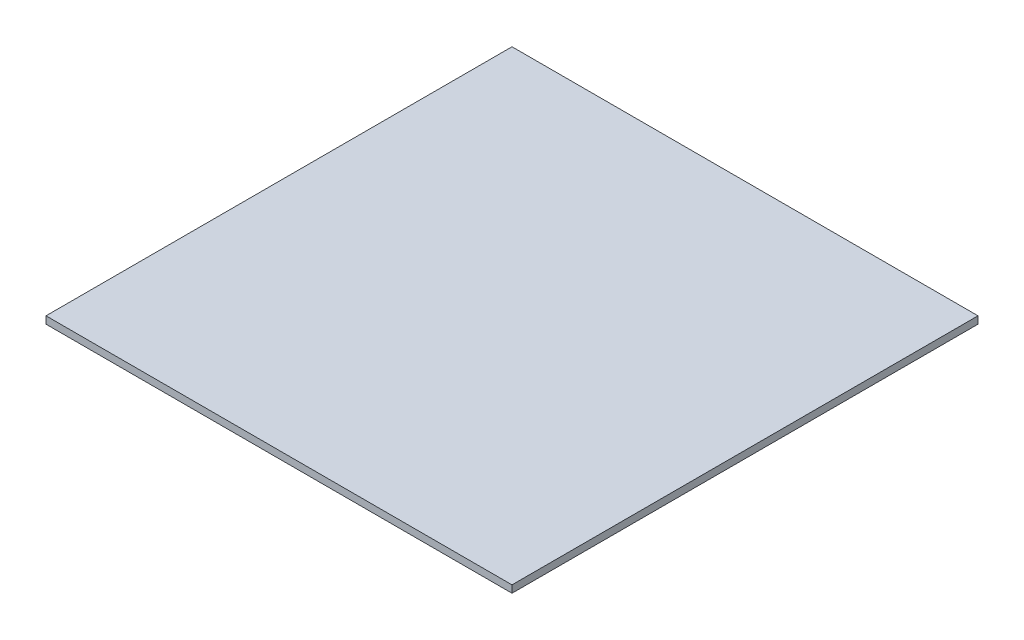
ISO-10303-21;
HEADER;
FILE_DESCRIPTION(('STEP AP214'),'2;1');
FILE_NAME('part.step','',(''),(''),'','','');
FILE_SCHEMA(('AUTOMOTIVE_DESIGN { 1 0 10303 214 1 1 1 1 }'));
ENDSEC;
DATA;
#1=APPLICATION_CONTEXT('core data for automotive mechanical design processes');
#2=APPLICATION_PROTOCOL_DEFINITION('international standard','automotive_design',2000,#1);
#3=PRODUCT_CONTEXT('',#1,'mechanical');
#4=PRODUCT('Part','Part','',(#3));
#5=PRODUCT_RELATED_PRODUCT_CATEGORY('part','',(#4));
#6=PRODUCT_DEFINITION_FORMATION('','',#4);
#7=PRODUCT_DEFINITION_CONTEXT('part definition',#1,'design');
#8=PRODUCT_DEFINITION('design','',#6,#7);
#9=PRODUCT_DEFINITION_SHAPE('','',#8);
#10=(LENGTH_UNIT() NAMED_UNIT(*) SI_UNIT(.MILLI.,.METRE.));
#11=(NAMED_UNIT(*) PLANE_ANGLE_UNIT() SI_UNIT($,.RADIAN.));
#12=(NAMED_UNIT(*) SI_UNIT($,.STERADIAN.) SOLID_ANGLE_UNIT());
#13=UNCERTAINTY_MEASURE_WITH_UNIT(LENGTH_MEASURE(1.E-05),#10,'distance_accuracy_value','');
#14=(GEOMETRIC_REPRESENTATION_CONTEXT(3) GLOBAL_UNCERTAINTY_ASSIGNED_CONTEXT((#13)) GLOBAL_UNIT_ASSIGNED_CONTEXT((#10,
#11,#12)) REPRESENTATION_CONTEXT('',''));
#15=CARTESIAN_POINT('',(0.,0.,0.));
#16=DIRECTION('',(0.,0.,1.));
#17=DIRECTION('',(1.,0.,0.));
#18=AXIS2_PLACEMENT_3D('',#15,#16,#17);
#19=CARTESIAN_POINT('',(-101.6,3.175,101.6));
#20=DIRECTION('',(1.,0.,0.));
#21=DIRECTION('',(0.,0.,-1.));
#22=AXIS2_PLACEMENT_3D('',#19,#20,#21);
#23=PLANE('',#22);
#24=DIRECTION('',(0.,0.,1.));
#25=VECTOR('',#24,1.);
#26=CARTESIAN_POINT('',(-101.6,0.,101.6));
#27=LINE('',#26,#25);
#28=CARTESIAN_POINT('',(-101.6,0.,-101.6));
#29=VERTEX_POINT('',#28);
#30=CARTESIAN_POINT('',(-101.6,0.,101.6));
#31=VERTEX_POINT('',#30);
#32=EDGE_CURVE('E100',#29,#31,#27,.T.);
#33=ORIENTED_EDGE('',*,*,#32,.T.);
#34=DIRECTION('',(0.,-1.,0.));
#35=VECTOR('',#34,1.);
#36=CARTESIAN_POINT('',(-101.6,3.175,101.6));
#37=LINE('',#36,#35);
#38=CARTESIAN_POINT('',(-101.6,3.175,101.6));
#39=VERTEX_POINT('',#38);
#40=EDGE_CURVE('E11',#39,#31,#37,.T.);
#41=ORIENTED_EDGE('',*,*,#40,.F.);
#42=DIRECTION('',(0.,0.,1.));
#43=VECTOR('',#42,1.);
#44=CARTESIAN_POINT('',(-101.6,3.175,101.6));
#45=LINE('',#44,#43);
#46=CARTESIAN_POINT('',(-101.6,3.175,-101.6));
#47=VERTEX_POINT('',#46);
#48=EDGE_CURVE('E88',#47,#39,#45,.T.);
#49=ORIENTED_EDGE('',*,*,#48,.F.);
#50=DIRECTION('',(0.,-1.,0.));
#51=VECTOR('',#50,1.);
#52=CARTESIAN_POINT('',(-101.6,3.175,-101.6));
#53=LINE('',#52,#51);
#54=EDGE_CURVE('E96',#47,#29,#53,.T.);
#55=ORIENTED_EDGE('',*,*,#54,.T.);
#56=EDGE_LOOP('',(#33,#41,#49,#55));
#57=FACE_BOUND('',#56,.T.);
#58=ADVANCED_FACE('F37',(#57),#23,.F.);
#59=CARTESIAN_POINT('',(101.6,3.175,101.6));
#60=DIRECTION('',(0.,0.,-1.));
#61=DIRECTION('',(-1.,0.,0.));
#62=AXIS2_PLACEMENT_3D('',#59,#60,#61);
#63=PLANE('',#62);
#64=DIRECTION('',(1.,0.,0.));
#65=VECTOR('',#64,1.);
#66=CARTESIAN_POINT('',(101.6,0.,101.6));
#67=LINE('',#66,#65);
#68=CARTESIAN_POINT('',(101.6,0.,101.6));
#69=VERTEX_POINT('',#68);
#70=EDGE_CURVE('E92',#31,#69,#67,.T.);
#71=ORIENTED_EDGE('',*,*,#70,.T.);
#72=DIRECTION('',(0.,-1.,0.));
#73=VECTOR('',#72,1.);
#74=CARTESIAN_POINT('',(101.6,3.175,101.6));
#75=LINE('',#74,#73);
#76=CARTESIAN_POINT('',(101.6,3.175,101.6));
#77=VERTEX_POINT('',#76);
#78=EDGE_CURVE('E45',#77,#69,#75,.T.);
#79=ORIENTED_EDGE('',*,*,#78,.F.);
#80=DIRECTION('',(1.,0.,0.));
#81=VECTOR('',#80,1.);
#82=CARTESIAN_POINT('',(101.6,3.175,101.6));
#83=LINE('',#82,#81);
#84=EDGE_CURVE('E83',#39,#77,#83,.T.);
#85=ORIENTED_EDGE('',*,*,#84,.F.);
#86=ORIENTED_EDGE('',*,*,#40,.T.);
#87=EDGE_LOOP('',(#71,#79,#85,#86));
#88=FACE_BOUND('',#87,.T.);
#89=ADVANCED_FACE('F91',(#88),#63,.F.);
#90=CARTESIAN_POINT('',(101.6,3.175,101.6));
#91=DIRECTION('',(-1.,0.,0.));
#92=DIRECTION('',(0.,0.,1.));
#93=AXIS2_PLACEMENT_3D('',#90,#91,#92);
#94=PLANE('',#93);
#95=DIRECTION('',(0.,0.,-1.));
#96=VECTOR('',#95,1.);
#97=CARTESIAN_POINT('',(101.6,0.,101.6));
#98=LINE('',#97,#96);
#99=CARTESIAN_POINT('',(101.6,0.,-101.6));
#100=VERTEX_POINT('',#99);
#101=EDGE_CURVE('E70',#69,#100,#98,.T.);
#102=ORIENTED_EDGE('',*,*,#101,.T.);
#103=DIRECTION('',(0.,-1.,0.));
#104=VECTOR('',#103,1.);
#105=CARTESIAN_POINT('',(101.6,3.175,-101.6));
#106=LINE('',#105,#104);
#107=CARTESIAN_POINT('',(101.6,3.175,-101.6));
#108=VERTEX_POINT('',#107);
#109=EDGE_CURVE('E93',#108,#100,#106,.T.);
#110=ORIENTED_EDGE('',*,*,#109,.F.);
#111=DIRECTION('',(0.,0.,-1.));
#112=VECTOR('',#111,1.);
#113=CARTESIAN_POINT('',(101.6,3.175,101.6));
#114=LINE('',#113,#112);
#115=EDGE_CURVE('E86',#77,#108,#114,.T.);
#116=ORIENTED_EDGE('',*,*,#115,.F.);
#117=ORIENTED_EDGE('',*,*,#78,.T.);
#118=EDGE_LOOP('',(#102,#110,#116,#117));
#119=FACE_BOUND('',#118,.T.);
#120=ADVANCED_FACE('F94',(#119),#94,.F.);
#121=CARTESIAN_POINT('',(101.6,3.175,-101.6));
#122=DIRECTION('',(0.,0.,1.));
#123=DIRECTION('',(1.,0.,0.));
#124=AXIS2_PLACEMENT_3D('',#121,#122,#123);
#125=PLANE('',#124);
#126=DIRECTION('',(-1.,0.,0.));
#127=VECTOR('',#126,1.);
#128=CARTESIAN_POINT('',(101.6,0.,-101.6));
#129=LINE('',#128,#127);
#130=EDGE_CURVE('E76',#100,#29,#129,.T.);
#131=ORIENTED_EDGE('',*,*,#130,.T.);
#132=ORIENTED_EDGE('',*,*,#54,.F.);
#133=DIRECTION('',(-1.,0.,0.));
#134=VECTOR('',#133,1.);
#135=CARTESIAN_POINT('',(101.6,3.175,-101.6));
#136=LINE('',#135,#134);
#137=EDGE_CURVE('E53',#108,#47,#136,.T.);
#138=ORIENTED_EDGE('',*,*,#137,.F.);
#139=ORIENTED_EDGE('',*,*,#109,.T.);
#140=EDGE_LOOP('',(#131,#132,#138,#139));
#141=FACE_BOUND('',#140,.T.);
#142=ADVANCED_FACE('F107',(#141),#125,.F.);
#143=CARTESIAN_POINT('',(0.,3.175,0.));
#144=DIRECTION('',(0.,1.,0.));
#145=DIRECTION('',(0.,0.,1.));
#146=AXIS2_PLACEMENT_3D('',#143,#144,#145);
#147=PLANE('',#146);
#148=ORIENTED_EDGE('',*,*,#48,.T.);
#149=ORIENTED_EDGE('',*,*,#84,.T.);
#150=ORIENTED_EDGE('',*,*,#115,.T.);
#151=ORIENTED_EDGE('',*,*,#137,.T.);
#152=EDGE_LOOP('',(#148,#149,#150,#151));
#153=FACE_BOUND('',#152,.T.);
#154=ADVANCED_FACE('F84',(#153),#147,.T.);
#155=CARTESIAN_POINT('',(0.,0.,0.));
#156=DIRECTION('',(0.,1.,0.));
#157=DIRECTION('',(0.,0.,1.));
#158=AXIS2_PLACEMENT_3D('',#155,#156,#157);
#159=PLANE('',#158);
#160=ORIENTED_EDGE('',*,*,#32,.F.);
#161=ORIENTED_EDGE('',*,*,#130,.F.);
#162=ORIENTED_EDGE('',*,*,#101,.F.);
#163=ORIENTED_EDGE('',*,*,#70,.F.);
#164=EDGE_LOOP('',(#160,#161,#162,#163));
#165=FACE_BOUND('',#164,.T.);
#166=ADVANCED_FACE('F110',(#165),#159,.F.);
#167=CLOSED_SHELL('',(#58,#89,#120,#142,#154,#166));
#168=MANIFOLD_SOLID_BREP('B2',#167);
#169=ADVANCED_BREP_SHAPE_REPRESENTATION('',(#18,#168),#14);
#170=SHAPE_DEFINITION_REPRESENTATION(#9,#169);
ENDSEC;
END-ISO-10303-21;
